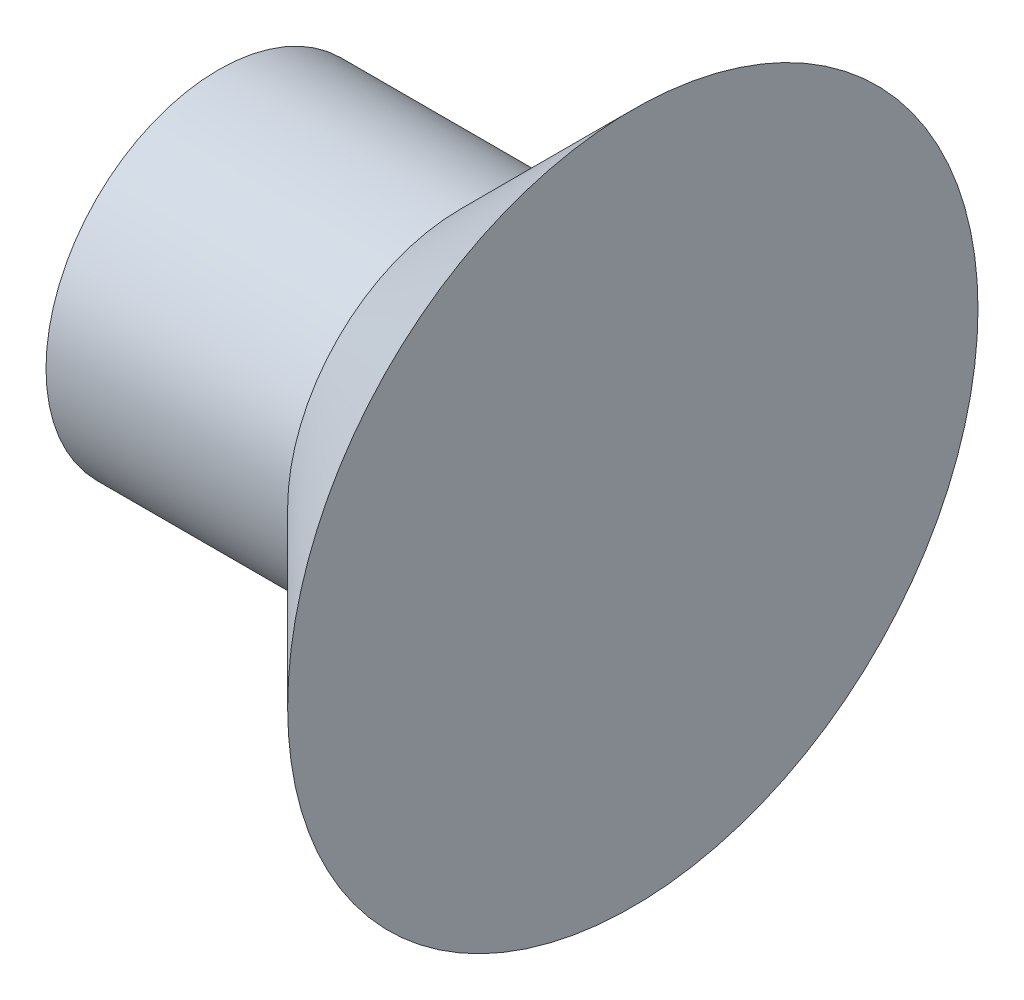
ISO-10303-21;
HEADER;
FILE_DESCRIPTION(('STEP AP214'),'2;1');
FILE_NAME('part.step','',(''),(''),'','','');
FILE_SCHEMA(('AUTOMOTIVE_DESIGN { 1 0 10303 214 1 1 1 1 }'));
ENDSEC;
DATA;
#1=APPLICATION_CONTEXT('core data for automotive mechanical design processes');
#2=APPLICATION_PROTOCOL_DEFINITION('international standard','automotive_design',2000,#1);
#3=PRODUCT_CONTEXT('',#1,'mechanical');
#4=PRODUCT('Part','Part','',(#3));
#5=PRODUCT_RELATED_PRODUCT_CATEGORY('part','',(#4));
#6=PRODUCT_DEFINITION_FORMATION('','',#4);
#7=PRODUCT_DEFINITION_CONTEXT('part definition',#1,'design');
#8=PRODUCT_DEFINITION('design','',#6,#7);
#9=PRODUCT_DEFINITION_SHAPE('','',#8);
#10=(LENGTH_UNIT() NAMED_UNIT(*) SI_UNIT(.MILLI.,.METRE.));
#11=(NAMED_UNIT(*) PLANE_ANGLE_UNIT() SI_UNIT($,.RADIAN.));
#12=(NAMED_UNIT(*) SI_UNIT($,.STERADIAN.) SOLID_ANGLE_UNIT());
#13=UNCERTAINTY_MEASURE_WITH_UNIT(LENGTH_MEASURE(1.E-05),#10,'distance_accuracy_value','');
#14=(GEOMETRIC_REPRESENTATION_CONTEXT(3) GLOBAL_UNCERTAINTY_ASSIGNED_CONTEXT((#13)) GLOBAL_UNIT_ASSIGNED_CONTEXT((#10,
#11,#12)) REPRESENTATION_CONTEXT('',''));
#15=CARTESIAN_POINT('',(0.,0.,0.));
#16=DIRECTION('',(0.,0.,1.));
#17=DIRECTION('',(1.,0.,0.));
#18=AXIS2_PLACEMENT_3D('',#15,#16,#17);
#19=CARTESIAN_POINT('',(0.,2.49999999999999,0.));
#20=DIRECTION('',(-1.,0.,0.));
#21=DIRECTION('',(0.,0.,1.));
#22=AXIS2_PLACEMENT_3D('',#19,#20,#21);
#23=PLANE('',#22);
#24=CARTESIAN_POINT('',(0.,0.,0.));
#25=DIRECTION('',(-1.,0.,0.));
#26=DIRECTION('',(0.,0.,1.));
#27=AXIS2_PLACEMENT_3D('',#24,#25,#26);
#28=CIRCLE('',#27,2.49999999999999);
#29=CARTESIAN_POINT('',(0.,0.,2.49999999999999));
#30=VERTEX_POINT('',#29);
#31=EDGE_CURVE('E10',#30,#30,#28,.T.);
#32=ORIENTED_EDGE('',*,*,#31,.F.);
#33=EDGE_LOOP('',(#32));
#34=FACE_BOUND('',#33,.T.);
#35=ADVANCED_FACE('F24',(#34),#23,.F.);
#36=CARTESIAN_POINT('',(0.,0.,0.));
#37=DIRECTION('',(1.,0.,0.));
#38=DIRECTION('',(0.,0.,-1.));
#39=AXIS2_PLACEMENT_3D('',#36,#37,#38);
#40=CONICAL_SURFACE('',#39,2.49999999999999,0.785398163397443);
#41=CARTESIAN_POINT('',(-1.25,0.,0.));
#42=DIRECTION('',(-1.,0.,0.));
#43=DIRECTION('',(0.,0.,1.));
#44=AXIS2_PLACEMENT_3D('',#41,#42,#43);
#45=CIRCLE('',#44,1.25);
#46=CARTESIAN_POINT('',(-1.25,0.,1.25));
#47=VERTEX_POINT('',#46);
#48=EDGE_CURVE('E30',#47,#47,#45,.T.);
#49=ORIENTED_EDGE('',*,*,#48,.F.);
#50=EDGE_LOOP('',(#49));
#51=FACE_BOUND('',#50,.T.);
#52=ORIENTED_EDGE('',*,*,#31,.T.);
#53=EDGE_LOOP('',(#52));
#54=FACE_BOUND('',#53,.T.);
#55=ADVANCED_FACE('F45',(#51,#54),#40,.T.);
#56=CARTESIAN_POINT('',(0.,0.,0.));
#57=DIRECTION('',(-1.,0.,0.));
#58=DIRECTION('',(0.,0.,1.));
#59=AXIS2_PLACEMENT_3D('',#56,#57,#58);
#60=CYLINDRICAL_SURFACE('',#59,1.25);
#61=CARTESIAN_POINT('',(-3.,0.,0.));
#62=DIRECTION('',(-1.,0.,0.));
#63=DIRECTION('',(0.,0.,1.));
#64=AXIS2_PLACEMENT_3D('',#61,#62,#63);
#65=CIRCLE('',#64,1.25);
#66=CARTESIAN_POINT('',(-3.,0.,1.25));
#67=VERTEX_POINT('',#66);
#68=EDGE_CURVE('E34',#67,#67,#65,.T.);
#69=ORIENTED_EDGE('',*,*,#68,.F.);
#70=EDGE_LOOP('',(#69));
#71=FACE_BOUND('',#70,.T.);
#72=ORIENTED_EDGE('',*,*,#48,.T.);
#73=EDGE_LOOP('',(#72));
#74=FACE_BOUND('',#73,.T.);
#75=ADVANCED_FACE('F43',(#71,#74),#60,.T.);
#76=CARTESIAN_POINT('',(-3.,0.,0.));
#77=DIRECTION('',(1.,0.,0.));
#78=DIRECTION('',(0.,0.,-1.));
#79=AXIS2_PLACEMENT_3D('',#76,#77,#78);
#80=PLANE('',#79);
#81=ORIENTED_EDGE('',*,*,#68,.T.);
#82=EDGE_LOOP('',(#81));
#83=FACE_BOUND('',#82,.T.);
#84=ADVANCED_FACE('F41',(#83),#80,.F.);
#85=CLOSED_SHELL('',(#35,#55,#75,#84));
#86=MANIFOLD_SOLID_BREP('B2',#85);
#87=ADVANCED_BREP_SHAPE_REPRESENTATION('',(#18,#86),#14);
#88=SHAPE_DEFINITION_REPRESENTATION(#9,#87);
ENDSEC;
END-ISO-10303-21;
